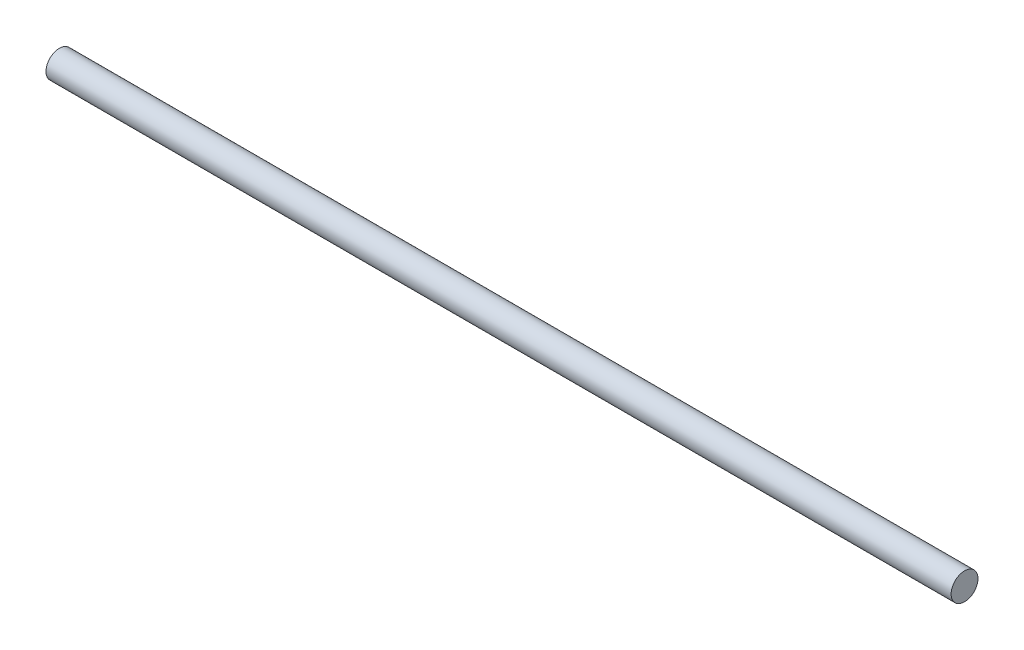
ISO-10303-21;
HEADER;
FILE_DESCRIPTION(('STEP AP214'),'2;1');
FILE_NAME('part.step','',(''),(''),'','','');
FILE_SCHEMA(('AUTOMOTIVE_DESIGN { 1 0 10303 214 1 1 1 1 }'));
ENDSEC;
DATA;
#1=APPLICATION_CONTEXT('core data for automotive mechanical design processes');
#2=APPLICATION_PROTOCOL_DEFINITION('international standard','automotive_design',2000,#1);
#3=PRODUCT_CONTEXT('',#1,'mechanical');
#4=PRODUCT('Part','Part','',(#3));
#5=PRODUCT_RELATED_PRODUCT_CATEGORY('part','',(#4));
#6=PRODUCT_DEFINITION_FORMATION('','',#4);
#7=PRODUCT_DEFINITION_CONTEXT('part definition',#1,'design');
#8=PRODUCT_DEFINITION('design','',#6,#7);
#9=PRODUCT_DEFINITION_SHAPE('','',#8);
#10=(LENGTH_UNIT() NAMED_UNIT(*) SI_UNIT(.MILLI.,.METRE.));
#11=(NAMED_UNIT(*) PLANE_ANGLE_UNIT() SI_UNIT($,.RADIAN.));
#12=(NAMED_UNIT(*) SI_UNIT($,.STERADIAN.) SOLID_ANGLE_UNIT());
#13=UNCERTAINTY_MEASURE_WITH_UNIT(LENGTH_MEASURE(1.E-05),#10,'distance_accuracy_value','');
#14=(GEOMETRIC_REPRESENTATION_CONTEXT(3) GLOBAL_UNCERTAINTY_ASSIGNED_CONTEXT((#13)) GLOBAL_UNIT_ASSIGNED_CONTEXT((#10,
#11,#12)) REPRESENTATION_CONTEXT('',''));
#15=CARTESIAN_POINT('',(0.,0.,0.));
#16=DIRECTION('',(0.,0.,1.));
#17=DIRECTION('',(1.,0.,0.));
#18=AXIS2_PLACEMENT_3D('',#15,#16,#17);
#19=CARTESIAN_POINT('',(160.,0.,0.));
#20=DIRECTION('',(-1.,0.,0.));
#21=DIRECTION('',(0.,0.,1.));
#22=AXIS2_PLACEMENT_3D('',#19,#20,#21);
#23=CYLINDRICAL_SURFACE('',#22,2.375);
#24=CARTESIAN_POINT('',(160.,0.,0.));
#25=DIRECTION('',(1.,0.,0.));
#26=DIRECTION('',(0.,0.,-1.));
#27=AXIS2_PLACEMENT_3D('',#24,#25,#26);
#28=CIRCLE('',#27,2.375);
#29=CARTESIAN_POINT('',(160.,0.,-2.375));
#30=VERTEX_POINT('',#29);
#31=EDGE_CURVE('E10',#30,#30,#28,.T.);
#32=ORIENTED_EDGE('',*,*,#31,.F.);
#33=EDGE_LOOP('',(#32));
#34=FACE_BOUND('',#33,.T.);
#35=CARTESIAN_POINT('',(0.,0.,0.));
#36=DIRECTION('',(1.,0.,0.));
#37=DIRECTION('',(0.,0.,-1.));
#38=AXIS2_PLACEMENT_3D('',#35,#36,#37);
#39=CIRCLE('',#38,2.375);
#40=CARTESIAN_POINT('',(0.,0.,-2.375));
#41=VERTEX_POINT('',#40);
#42=EDGE_CURVE('E34',#41,#41,#39,.T.);
#43=ORIENTED_EDGE('',*,*,#42,.T.);
#44=EDGE_LOOP('',(#43));
#45=FACE_BOUND('',#44,.T.);
#46=ADVANCED_FACE('F31',(#34,#45),#23,.T.);
#47=CARTESIAN_POINT('',(160.,0.,0.));
#48=DIRECTION('',(1.,0.,0.));
#49=DIRECTION('',(0.,0.,-1.));
#50=AXIS2_PLACEMENT_3D('',#47,#48,#49);
#51=PLANE('',#50);
#52=ORIENTED_EDGE('',*,*,#31,.T.);
#53=EDGE_LOOP('',(#52));
#54=FACE_BOUND('',#53,.T.);
#55=ADVANCED_FACE('F46',(#54),#51,.T.);
#56=CARTESIAN_POINT('',(0.,0.,0.));
#57=DIRECTION('',(1.,0.,0.));
#58=DIRECTION('',(0.,0.,-1.));
#59=AXIS2_PLACEMENT_3D('',#56,#57,#58);
#60=PLANE('',#59);
#61=ORIENTED_EDGE('',*,*,#42,.F.);
#62=EDGE_LOOP('',(#61));
#63=FACE_BOUND('',#62,.T.);
#64=ADVANCED_FACE('F44',(#63),#60,.F.);
#65=CLOSED_SHELL('',(#46,#55,#64));
#66=MANIFOLD_SOLID_BREP('B2',#65);
#67=ADVANCED_BREP_SHAPE_REPRESENTATION('',(#18,#66),#14);
#68=SHAPE_DEFINITION_REPRESENTATION(#9,#67);
ENDSEC;
END-ISO-10303-21;
